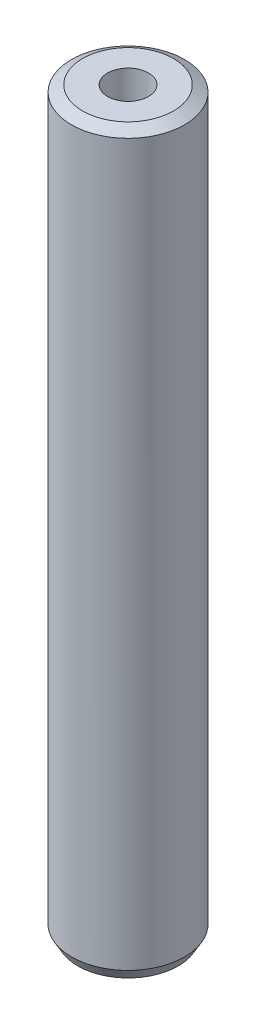
ISO-10303-21;
HEADER;
FILE_DESCRIPTION(('STEP AP214'),'2;1');
FILE_NAME('part.step','',(''),(''),'','','');
FILE_SCHEMA(('AUTOMOTIVE_DESIGN { 1 0 10303 214 1 1 1 1 }'));
ENDSEC;
DATA;
#1=APPLICATION_CONTEXT('core data for automotive mechanical design processes');
#2=APPLICATION_PROTOCOL_DEFINITION('international standard','automotive_design',2000,#1);
#3=PRODUCT_CONTEXT('',#1,'mechanical');
#4=PRODUCT('Part','Part','',(#3));
#5=PRODUCT_RELATED_PRODUCT_CATEGORY('part','',(#4));
#6=PRODUCT_DEFINITION_FORMATION('','',#4);
#7=PRODUCT_DEFINITION_CONTEXT('part definition',#1,'design');
#8=PRODUCT_DEFINITION('design','',#6,#7);
#9=PRODUCT_DEFINITION_SHAPE('','',#8);
#10=(LENGTH_UNIT() NAMED_UNIT(*) SI_UNIT(.MILLI.,.METRE.));
#11=(NAMED_UNIT(*) PLANE_ANGLE_UNIT() SI_UNIT($,.RADIAN.));
#12=(NAMED_UNIT(*) SI_UNIT($,.STERADIAN.) SOLID_ANGLE_UNIT());
#13=UNCERTAINTY_MEASURE_WITH_UNIT(LENGTH_MEASURE(1.E-05),#10,'distance_accuracy_value','');
#14=(GEOMETRIC_REPRESENTATION_CONTEXT(3) GLOBAL_UNCERTAINTY_ASSIGNED_CONTEXT((#13)) GLOBAL_UNIT_ASSIGNED_CONTEXT((#10,
#11,#12)) REPRESENTATION_CONTEXT('',''));
#15=CARTESIAN_POINT('',(0.,0.,0.));
#16=DIRECTION('',(0.,0.,1.));
#17=DIRECTION('',(1.,0.,0.));
#18=AXIS2_PLACEMENT_3D('',#15,#16,#17);
#19=CARTESIAN_POINT('',(0.,97.8374832261176,0.));
#20=DIRECTION('',(0.,-1.,0.));
#21=DIRECTION('',(0.,0.,-1.));
#22=AXIS2_PLACEMENT_3D('',#19,#20,#21);
#23=CYLINDRICAL_SURFACE('',#22,7.5);
#24=CARTESIAN_POINT('',(0.,96.9870283726851,0.));
#25=DIRECTION('',(0.,1.,0.));
#26=DIRECTION('',(0.,0.,1.));
#27=AXIS2_PLACEMENT_3D('',#24,#25,#26);
#28=CIRCLE('',#27,7.5);
#29=CARTESIAN_POINT('',(0.,96.9870283726851,-7.5));
#30=VERTEX_POINT('',#29);
#31=EDGE_CURVE('E50',#30,#30,#28,.F.);
#32=CARTESIAN_POINT('',(0.,1.47303101568873,0.));
#33=DIRECTION('',(0.,1.,0.));
#34=DIRECTION('',(0.,0.,1.));
#35=AXIS2_PLACEMENT_3D('',#32,#33,#34);
#36=CIRCLE('',#35,7.5);
#37=CARTESIAN_POINT('',(0.,1.47303101568873,-7.5));
#38=VERTEX_POINT('',#37);
#39=EDGE_CURVE('E51',#38,#38,#36,.T.);
#40=CARTESIAN_POINT('',(0.,96.9870283726851,-7.5));
#41=CARTESIAN_POINT('',(0.,95.9920909002164,-7.5));
#42=CARTESIAN_POINT('',(0.,94.9971534277477,-7.5));
#43=CARTESIAN_POINT('',(0.,93.0072784828102,-7.5));
#44=CARTESIAN_POINT('',(0.,92.0123410103415,-7.5));
#45=CARTESIAN_POINT('',(0.,90.0224660654041,-7.5));
#46=CARTESIAN_POINT('',(0.,89.0275285929354,-7.5));
#47=CARTESIAN_POINT('',(0.,87.037653647998,-7.5));
#48=CARTESIAN_POINT('',(0.,86.0427161755293,-7.5));
#49=CARTESIAN_POINT('',(0.,84.0528412305918,-7.5));
#50=CARTESIAN_POINT('',(0.,83.0579037581231,-7.5));
#51=CARTESIAN_POINT('',(0.,81.0680288131857,-7.5));
#52=CARTESIAN_POINT('',(0.,80.073091340717,-7.5));
#53=CARTESIAN_POINT('',(0.,78.0832163957796,-7.5));
#54=CARTESIAN_POINT('',(0.,77.0882789233109,-7.5));
#55=CARTESIAN_POINT('',(0.,75.0984039783734,-7.5));
#56=CARTESIAN_POINT('',(0.,74.1034665059047,-7.5));
#57=CARTESIAN_POINT('',(0.,72.1135915609673,-7.5));
#58=CARTESIAN_POINT('',(0.,71.1186540884986,-7.5));
#59=CARTESIAN_POINT('',(0.,69.1287791435611,-7.5));
#60=CARTESIAN_POINT('',(0.,68.1338416710924,-7.5));
#61=CARTESIAN_POINT('',(0.,66.143966726155,-7.5));
#62=CARTESIAN_POINT('',(0.,65.1490292536863,-7.5));
#63=CARTESIAN_POINT('',(0.,63.1591543087489,-7.5));
#64=CARTESIAN_POINT('',(0.,62.1642168362802,-7.5));
#65=CARTESIAN_POINT('',(0.,60.1743418913427,-7.5));
#66=CARTESIAN_POINT('',(0.,59.179404418874,-7.5));
#67=CARTESIAN_POINT('',(0.,57.1895294739366,-7.5));
#68=CARTESIAN_POINT('',(0.,56.1945920014679,-7.5));
#69=CARTESIAN_POINT('',(0.,54.2047170565305,-7.5));
#70=CARTESIAN_POINT('',(0.,53.2097795840618,-7.5));
#71=CARTESIAN_POINT('',(0.,51.2199046391243,-7.5));
#72=CARTESIAN_POINT('',(0.,50.2249671666556,-7.5));
#73=CARTESIAN_POINT('',(0.,48.2350922217182,-7.5));
#74=CARTESIAN_POINT('',(0.,47.2401547492495,-7.5));
#75=CARTESIAN_POINT('',(0.,45.2502798043121,-7.5));
#76=CARTESIAN_POINT('',(0.,44.2553423318433,-7.5));
#77=CARTESIAN_POINT('',(0.,42.2654673869059,-7.5));
#78=CARTESIAN_POINT('',(0.,41.2705299144372,-7.5));
#79=CARTESIAN_POINT('',(0.,39.2806549694998,-7.5));
#80=CARTESIAN_POINT('',(0.,38.2857174970311,-7.5));
#81=CARTESIAN_POINT('',(0.,36.2958425520937,-7.5));
#82=CARTESIAN_POINT('',(0.,35.300905079625,-7.5));
#83=CARTESIAN_POINT('',(0.,33.3110301346875,-7.5));
#84=CARTESIAN_POINT('',(0.,32.3160926622188,-7.5));
#85=CARTESIAN_POINT('',(0.,30.3262177172814,-7.5));
#86=CARTESIAN_POINT('',(0.,29.3312802448127,-7.5));
#87=CARTESIAN_POINT('',(0.,27.3414052998753,-7.5));
#88=CARTESIAN_POINT('',(0.,26.3464678274065,-7.5));
#89=CARTESIAN_POINT('',(0.,24.3565928824691,-7.5));
#90=CARTESIAN_POINT('',(0.,23.3616554100004,-7.5));
#91=CARTESIAN_POINT('',(0.,21.371780465063,-7.5));
#92=CARTESIAN_POINT('',(0.,20.3768429925943,-7.5));
#93=CARTESIAN_POINT('',(0.,18.3869680476568,-7.5));
#94=CARTESIAN_POINT('',(0.,17.3920305751881,-7.5));
#95=CARTESIAN_POINT('',(0.,15.4021556302507,-7.5));
#96=CARTESIAN_POINT('',(0.,14.407218157782,-7.5));
#97=CARTESIAN_POINT('',(0.,12.4173432128446,-7.5));
#98=CARTESIAN_POINT('',(0.,11.4224057403759,-7.5));
#99=CARTESIAN_POINT('',(0.,9.43253079543844,-7.5));
#100=CARTESIAN_POINT('',(0.,8.43759332296972,-7.5));
#101=CARTESIAN_POINT('',(0.,6.4477183780323,-7.5));
#102=CARTESIAN_POINT('',(0.,5.45278090556358,-7.5));
#103=CARTESIAN_POINT('',(0.,3.46290596062616,-7.5));
#104=CARTESIAN_POINT('',(0.,2.46796848815744,-7.5));
#105=CARTESIAN_POINT('',(0.,1.47303101568873,-7.5));
#106=B_SPLINE_CURVE_WITH_KNOTS('',3,(#40,#41,#42,#43,#44,#45,#46,#47,#48,#49,#50,#51,#52,#53,
#54,#55,#56,#57,#58,#59,#60,#61,#62,#63,#64,#65,#66,#67,#68,#69,#70,#71,#72,#73,#74,#75,#76,#77,
#78,#79,#80,#81,#82,#83,#84,#85,#86,#87,#88,#89,#90,#91,#92,#93,#94,#95,#96,#97,#98,#99,#100,
#101,#102,#103,#104,#105),.UNSPECIFIED.,.F.,.F.,(4,2,2,2,2,2,2,2,2,2,2,2,2,2,2,2,2,2,2,2,2,2,2,
2,2,2,2,2,2,2,2,2,4),(0.,2.98481241740614,5.96962483481228,8.95443725221841,11.9392496696245,
14.9240620870307,17.9088745044368,20.893686921843,23.8784993392491,26.8633117566552,
29.8481241740614,32.8329365914675,35.8177490088736,38.8025614262798,41.7873738436859,
44.7721862610921,47.7569986784982,50.7418110959043,53.7266235133105,56.7114359307166,
59.6962483481227,62.6810607655288,65.665873182935,68.6506856003411,71.6354980177473,
74.6203104351534,77.6051228525595,80.5899352699657,83.5747476873718,86.5595601047779,
89.5443725221841,92.5291849395902,95.5139973569964),.UNSPECIFIED.);
#107=EDGE_CURVE('BSEAM39',#30,#38,#106,.T.);
#108=ORIENTED_EDGE('',*,*,#31,.T.);
#109=ORIENTED_EDGE('',*,*,#39,.T.);
#110=ORIENTED_EDGE('',*,*,#107,.T.);
#111=ORIENTED_EDGE('',*,*,#107,.F.);
#112=EDGE_LOOP('',(#108,#110,#109,#111));
#113=FACE_BOUND('',#112,.T.);
#114=ADVANCED_FACE('F39',(#113),#23,.T.);
#115=CARTESIAN_POINT('',(0.,97.8374832261176,0.));
#116=DIRECTION('',(0.,1.,0.));
#117=DIRECTION('',(0.,0.,1.));
#118=AXIS2_PLACEMENT_3D('',#115,#116,#117);
#119=PLANE('',#118);
#120=CARTESIAN_POINT('',(0.,97.8374832261176,0.));
#121=DIRECTION('',(0.,1.,0.));
#122=DIRECTION('',(0.,0.,1.));
#123=AXIS2_PLACEMENT_3D('',#120,#121,#122);
#124=CIRCLE('',#123,6.0269689843114);
#125=CARTESIAN_POINT('',(0.,97.8374832261176,6.0269689843114));
#126=VERTEX_POINT('',#125);
#127=EDGE_CURVE('E54',#126,#126,#124,.T.);
#128=ORIENTED_EDGE('',*,*,#127,.T.);
#129=EDGE_LOOP('',(#128));
#130=FACE_BOUND('',#129,.T.);
#131=CARTESIAN_POINT('',(0.,97.8374832261176,0.));
#132=DIRECTION('',(0.,1.,0.));
#133=DIRECTION('',(0.,0.,1.));
#134=AXIS2_PLACEMENT_3D('',#131,#132,#133);
#135=CIRCLE('',#134,2.71076183970043);
#136=CARTESIAN_POINT('',(0.,97.8374832261176,-2.71076183970043));
#137=VERTEX_POINT('',#136);
#138=EDGE_CURVE('E58',#137,#137,#135,.T.);
#139=ORIENTED_EDGE('',*,*,#138,.F.);
#140=EDGE_LOOP('',(#139));
#141=FACE_BOUND('',#140,.T.);
#142=ADVANCED_FACE('F69',(#130,#141),#119,.T.);
#143=CARTESIAN_POINT('',(0.,0.,0.));
#144=DIRECTION('',(0.,1.,0.));
#145=DIRECTION('',(0.,0.,1.));
#146=AXIS2_PLACEMENT_3D('',#143,#144,#145);
#147=PLANE('',#146);
#148=CARTESIAN_POINT('',(0.,0.,0.));
#149=DIRECTION('',(0.,1.,0.));
#150=DIRECTION('',(0.,0.,1.));
#151=AXIS2_PLACEMENT_3D('',#148,#149,#150);
#152=CIRCLE('',#151,6.64954514656744);
#153=CARTESIAN_POINT('',(0.,0.,6.64954514656744));
#154=VERTEX_POINT('',#153);
#155=EDGE_CURVE('E10',#154,#154,#152,.F.);
#156=ORIENTED_EDGE('',*,*,#155,.T.);
#157=EDGE_LOOP('',(#156));
#158=FACE_BOUND('',#157,.T.);
#159=CARTESIAN_POINT('',(0.,0.,0.));
#160=DIRECTION('',(0.,1.,0.));
#161=DIRECTION('',(0.,0.,1.));
#162=AXIS2_PLACEMENT_3D('',#159,#160,#161);
#163=CIRCLE('',#162,2.71076183970043);
#164=CARTESIAN_POINT('',(0.,0.,-2.71076183970043));
#165=VERTEX_POINT('',#164);
#166=EDGE_CURVE('E63',#165,#165,#163,.T.);
#167=ORIENTED_EDGE('',*,*,#166,.T.);
#168=EDGE_LOOP('',(#167));
#169=FACE_BOUND('',#168,.T.);
#170=ADVANCED_FACE('F75',(#158,#169),#147,.F.);
#171=CARTESIAN_POINT('',(0.,97.8374832261176,0.));
#172=DIRECTION('',(0.,-1.,0.));
#173=DIRECTION('',(0.,0.,-1.));
#174=AXIS2_PLACEMENT_3D('',#171,#172,#173);
#175=CYLINDRICAL_SURFACE('',#174,2.71076183970043);
#176=CARTESIAN_POINT('',(0.,97.8374832261176,-2.71076183970043));
#177=CARTESIAN_POINT('',(0.,96.8183427758455,-2.71076183970043));
#178=CARTESIAN_POINT('',(0.,95.7992023255734,-2.71076183970043));
#179=CARTESIAN_POINT('',(0.,93.7609214250293,-2.71076183970043));
#180=CARTESIAN_POINT('',(0.,92.7417809747573,-2.71076183970043));
#181=CARTESIAN_POINT('',(0.,90.7035000742132,-2.71076183970043));
#182=CARTESIAN_POINT('',(0.,89.6843596239411,-2.71076183970043));
#183=CARTESIAN_POINT('',(0.,87.646078723397,-2.71076183970043));
#184=CARTESIAN_POINT('',(0.,86.6269382731249,-2.71076183970043));
#185=CARTESIAN_POINT('',(0.,84.5886573725808,-2.71076183970043));
#186=CARTESIAN_POINT('',(0.,83.5695169223088,-2.71076183970043));
#187=CARTESIAN_POINT('',(0.,81.5312360217646,-2.71076183970043));
#188=CARTESIAN_POINT('',(0.,80.5120955714926,-2.71076183970043));
#189=CARTESIAN_POINT('',(0.,78.4738146709485,-2.71076183970043));
#190=CARTESIAN_POINT('',(0.,77.4546742206764,-2.71076183970043));
#191=CARTESIAN_POINT('',(0.,75.4163933201323,-2.71076183970043));
#192=CARTESIAN_POINT('',(0.,74.3972528698602,-2.71076183970043));
#193=CARTESIAN_POINT('',(0.,72.3589719693161,-2.71076183970043));
#194=CARTESIAN_POINT('',(0.,71.3398315190441,-2.71076183970043));
#195=CARTESIAN_POINT('',(0.,69.3015506184999,-2.71076183970043));
#196=CARTESIAN_POINT('',(0.,68.2824101682279,-2.71076183970043));
#197=CARTESIAN_POINT('',(0.,66.2441292676838,-2.71076183970043));
#198=CARTESIAN_POINT('',(0.,65.2249888174117,-2.71076183970043));
#199=CARTESIAN_POINT('',(0.,63.1867079168676,-2.71076183970043));
#200=CARTESIAN_POINT('',(0.,62.1675674665955,-2.71076183970043));
#201=CARTESIAN_POINT('',(0.,60.1292865660514,-2.71076183970043));
#202=CARTESIAN_POINT('',(0.,59.1101461157794,-2.71076183970043));
#203=CARTESIAN_POINT('',(0.,57.0718652152352,-2.71076183970043));
#204=CARTESIAN_POINT('',(0.,56.0527247649632,-2.71076183970043));
#205=CARTESIAN_POINT('',(0.,54.0144438644191,-2.71076183970043));
#206=CARTESIAN_POINT('',(0.,52.995303414147,-2.71076183970043));
#207=CARTESIAN_POINT('',(0.,50.9570225136029,-2.71076183970043));
#208=CARTESIAN_POINT('',(0.,49.9378820633308,-2.71076183970043));
#209=CARTESIAN_POINT('',(0.,47.8996011627867,-2.71076183970043));
#210=CARTESIAN_POINT('',(0.,46.8804607125147,-2.71076183970043));
#211=CARTESIAN_POINT('',(0.,44.8421798119705,-2.71076183970043));
#212=CARTESIAN_POINT('',(0.,43.8230393616985,-2.71076183970043));
#213=CARTESIAN_POINT('',(0.,41.7847584611544,-2.71076183970043));
#214=CARTESIAN_POINT('',(0.,40.7656180108823,-2.71076183970043));
#215=CARTESIAN_POINT('',(0.,38.7273371103382,-2.71076183970043));
#216=CARTESIAN_POINT('',(0.,37.7081966600661,-2.71076183970043));
#217=CARTESIAN_POINT('',(0.,35.669915759522,-2.71076183970043));
#218=CARTESIAN_POINT('',(0.,34.65077530925,-2.71076183970043));
#219=CARTESIAN_POINT('',(0.,32.6124944087058,-2.71076183970043));
#220=CARTESIAN_POINT('',(0.,31.5933539584338,-2.71076183970043));
#221=CARTESIAN_POINT('',(0.,29.5550730578897,-2.71076183970043));
#222=CARTESIAN_POINT('',(0.,28.5359326076176,-2.71076183970043));
#223=CARTESIAN_POINT('',(0.,26.4976517070735,-2.71076183970043));
#224=CARTESIAN_POINT('',(0.,25.4785112568014,-2.71076183970043));
#225=CARTESIAN_POINT('',(0.,23.4402303562573,-2.71076183970043));
#226=CARTESIAN_POINT('',(0.,22.4210899059853,-2.71076183970043));
#227=CARTESIAN_POINT('',(0.,20.3828090054411,-2.71076183970043));
#228=CARTESIAN_POINT('',(0.,19.3636685551691,-2.71076183970043));
#229=CARTESIAN_POINT('',(0.,17.325387654625,-2.71076183970043));
#230=CARTESIAN_POINT('',(0.,16.3062472043529,-2.71076183970043));
#231=CARTESIAN_POINT('',(0.,14.2679663038088,-2.71076183970043));
#232=CARTESIAN_POINT('',(0.,13.2488258535367,-2.71076183970043));
#233=CARTESIAN_POINT('',(0.,11.2105449529926,-2.71076183970043));
#234=CARTESIAN_POINT('',(0.,10.1914045027206,-2.71076183970043));
#235=CARTESIAN_POINT('',(0.,8.15312360217645,-2.71076183970043));
#236=CARTESIAN_POINT('',(0.,7.13398315190439,-2.71076183970043));
#237=CARTESIAN_POINT('',(0.,5.09570225136027,-2.71076183970043));
#238=CARTESIAN_POINT('',(0.,4.07656180108822,-2.71076183970043));
#239=CARTESIAN_POINT('',(0.,2.0382809005441,-2.71076183970043));
#240=CARTESIAN_POINT('',(0.,1.01914045027204,-2.71076183970043));
#241=CARTESIAN_POINT('',(0.,0.,-2.71076183970043));
#242=B_SPLINE_CURVE_WITH_KNOTS('',3,(#176,#177,#178,#179,#180,#181,#182,#183,#184,#185,#186,
#187,#188,#189,#190,#191,#192,#193,#194,#195,#196,#197,#198,#199,#200,#201,#202,#203,#204,#205,
#206,#207,#208,#209,#210,#211,#212,#213,#214,#215,#216,#217,#218,#219,#220,#221,#222,#223,#224,
#225,#226,#227,#228,#229,#230,#231,#232,#233,#234,#235,#236,#237,#238,#239,#240,#241),
.UNSPECIFIED.,.F.,.F.,(4,2,2,2,2,2,2,2,2,2,2,2,2,2,2,2,2,2,2,2,2,2,2,2,2,2,2,2,2,2,2,2,4),(0.,
3.05742135081617,6.11484270163234,9.17226405244852,12.2296854032647,15.2871067540809,
18.344528104897,21.4019494557132,24.4593708065294,27.5167921573456,30.5742135081617,
33.6316348589779,36.6890562097941,39.7464775606103,42.8038989114264,45.8613202622426,
48.9187416130588,51.9761629638749,55.0335843146911,58.0910056655073,61.1484270163235,
64.2058483671397,67.2632697179558,70.320691068772,73.3781124195882,76.4355337704043,
79.4929551212205,82.5503764720367,85.6077978228529,88.6652191736691,91.7226405244852,
94.7800618753014,97.8374832261176),.UNSPECIFIED.);
#243=EDGE_CURVE('BSEAM70',#137,#165,#242,.T.);
#244=ORIENTED_EDGE('',*,*,#138,.T.);
#245=ORIENTED_EDGE('',*,*,#166,.F.);
#246=ORIENTED_EDGE('',*,*,#243,.T.);
#247=ORIENTED_EDGE('',*,*,#243,.F.);
#248=EDGE_LOOP('',(#244,#246,#245,#247));
#249=FACE_BOUND('',#248,.T.);
#250=ADVANCED_FACE('F70',(#249),#175,.F.);
#251=CARTESIAN_POINT('',(0.,97.8374832261176,0.));
#252=DIRECTION('',(0.,-1.,0.));
#253=DIRECTION('',(0.,0.,-1.));
#254=AXIS2_PLACEMENT_3D('',#251,#252,#253);
#255=CONICAL_SURFACE('',#254,6.0269689843114,1.0471975511966);
#256=ORIENTED_EDGE('',*,*,#31,.F.);
#257=EDGE_LOOP('',(#256));
#258=FACE_BOUND('',#257,.T.);
#259=ORIENTED_EDGE('',*,*,#127,.F.);
#260=EDGE_LOOP('',(#259));
#261=FACE_BOUND('',#260,.T.);
#262=ADVANCED_FACE('F81',(#258,#261),#255,.T.);
#263=CARTESIAN_POINT('',(0.,1.47303101568873,0.));
#264=DIRECTION('',(0.,1.,0.));
#265=DIRECTION('',(0.,0.,1.));
#266=AXIS2_PLACEMENT_3D('',#263,#264,#265);
#267=CONICAL_SURFACE('',#266,7.5,0.523598775598303);
#268=ORIENTED_EDGE('',*,*,#155,.F.);
#269=EDGE_LOOP('',(#268));
#270=FACE_BOUND('',#269,.T.);
#271=ORIENTED_EDGE('',*,*,#39,.F.);
#272=EDGE_LOOP('',(#271));
#273=FACE_BOUND('',#272,.T.);
#274=ADVANCED_FACE('F45',(#270,#273),#267,.T.);
#275=CLOSED_SHELL('',(#114,#142,#170,#250,#262,#274));
#276=MANIFOLD_SOLID_BREP('B2',#275);
#277=ADVANCED_BREP_SHAPE_REPRESENTATION('',(#18,#276),#14);
#278=SHAPE_DEFINITION_REPRESENTATION(#9,#277);
ENDSEC;
END-ISO-10303-21;
